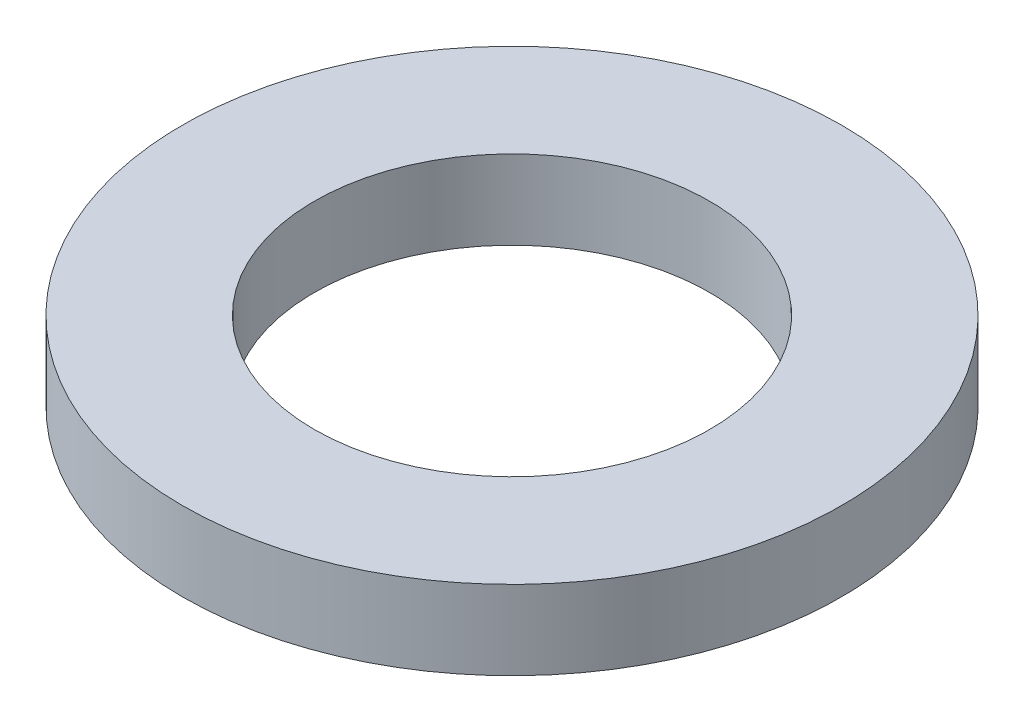
ISO-10303-21;
HEADER;
FILE_DESCRIPTION(('STEP AP214'),'2;1');
FILE_NAME('part.step','',(''),(''),'','','');
FILE_SCHEMA(('AUTOMOTIVE_DESIGN { 1 0 10303 214 1 1 1 1 }'));
ENDSEC;
DATA;
#1=APPLICATION_CONTEXT('core data for automotive mechanical design processes');
#2=APPLICATION_PROTOCOL_DEFINITION('international standard','automotive_design',2000,#1);
#3=PRODUCT_CONTEXT('',#1,'mechanical');
#4=PRODUCT('Part','Part','',(#3));
#5=PRODUCT_RELATED_PRODUCT_CATEGORY('part','',(#4));
#6=PRODUCT_DEFINITION_FORMATION('','',#4);
#7=PRODUCT_DEFINITION_CONTEXT('part definition',#1,'design');
#8=PRODUCT_DEFINITION('design','',#6,#7);
#9=PRODUCT_DEFINITION_SHAPE('','',#8);
#10=(LENGTH_UNIT() NAMED_UNIT(*) SI_UNIT(.MILLI.,.METRE.));
#11=(NAMED_UNIT(*) PLANE_ANGLE_UNIT() SI_UNIT($,.RADIAN.));
#12=(NAMED_UNIT(*) SI_UNIT($,.STERADIAN.) SOLID_ANGLE_UNIT());
#13=UNCERTAINTY_MEASURE_WITH_UNIT(LENGTH_MEASURE(1.E-05),#10,'distance_accuracy_value','');
#14=(GEOMETRIC_REPRESENTATION_CONTEXT(3) GLOBAL_UNCERTAINTY_ASSIGNED_CONTEXT((#13)) GLOBAL_UNIT_ASSIGNED_CONTEXT((#10,
#11,#12)) REPRESENTATION_CONTEXT('',''));
#15=CARTESIAN_POINT('',(0.,0.,0.));
#16=DIRECTION('',(0.,0.,1.));
#17=DIRECTION('',(1.,0.,0.));
#18=AXIS2_PLACEMENT_3D('',#15,#16,#17);
#19=CARTESIAN_POINT('',(0.,6.,0.));
#20=DIRECTION('',(0.,-1.,0.));
#21=DIRECTION('',(0.,0.,-1.));
#22=AXIS2_PLACEMENT_3D('',#19,#20,#21);
#23=CYLINDRICAL_SURFACE('',#22,25.);
#24=CARTESIAN_POINT('',(0.,6.,0.));
#25=DIRECTION('',(0.,1.,0.));
#26=DIRECTION('',(0.,0.,1.));
#27=AXIS2_PLACEMENT_3D('',#24,#25,#26);
#28=CIRCLE('',#27,25.);
#29=CARTESIAN_POINT('',(0.,6.,25.));
#30=VERTEX_POINT('',#29);
#31=EDGE_CURVE('E10',#30,#30,#28,.T.);
#32=ORIENTED_EDGE('',*,*,#31,.F.);
#33=EDGE_LOOP('',(#32));
#34=FACE_BOUND('',#33,.T.);
#35=CARTESIAN_POINT('',(0.,0.,0.));
#36=DIRECTION('',(0.,1.,0.));
#37=DIRECTION('',(0.,0.,1.));
#38=AXIS2_PLACEMENT_3D('',#35,#36,#37);
#39=CIRCLE('',#38,25.);
#40=CARTESIAN_POINT('',(0.,0.,25.));
#41=VERTEX_POINT('',#40);
#42=EDGE_CURVE('E37',#41,#41,#39,.T.);
#43=ORIENTED_EDGE('',*,*,#42,.T.);
#44=EDGE_LOOP('',(#43));
#45=FACE_BOUND('',#44,.T.);
#46=ADVANCED_FACE('F40',(#34,#45),#23,.T.);
#47=CARTESIAN_POINT('',(0.,6.,0.));
#48=DIRECTION('',(0.,1.,0.));
#49=DIRECTION('',(0.,0.,1.));
#50=AXIS2_PLACEMENT_3D('',#47,#48,#49);
#51=PLANE('',#50);
#52=CARTESIAN_POINT('',(0.,6.,0.));
#53=DIRECTION('',(0.,1.,0.));
#54=DIRECTION('',(0.,0.,1.));
#55=AXIS2_PLACEMENT_3D('',#52,#53,#54);
#56=CIRCLE('',#55,15.);
#57=CARTESIAN_POINT('',(0.,6.,15.));
#58=VERTEX_POINT('',#57);
#59=EDGE_CURVE('E50',#58,#58,#56,.T.);
#60=ORIENTED_EDGE('',*,*,#59,.F.);
#61=EDGE_LOOP('',(#60));
#62=FACE_BOUND('',#61,.T.);
#63=ORIENTED_EDGE('',*,*,#31,.T.);
#64=EDGE_LOOP('',(#63));
#65=FACE_BOUND('',#64,.T.);
#66=ADVANCED_FACE('F59',(#62,#65),#51,.T.);
#67=CARTESIAN_POINT('',(0.,0.,0.));
#68=DIRECTION('',(0.,1.,0.));
#69=DIRECTION('',(0.,0.,1.));
#70=AXIS2_PLACEMENT_3D('',#67,#68,#69);
#71=PLANE('',#70);
#72=CARTESIAN_POINT('',(0.,0.,0.));
#73=DIRECTION('',(0.,1.,0.));
#74=DIRECTION('',(0.,0.,1.));
#75=AXIS2_PLACEMENT_3D('',#72,#73,#74);
#76=CIRCLE('',#75,15.);
#77=CARTESIAN_POINT('',(0.,0.,15.));
#78=VERTEX_POINT('',#77);
#79=EDGE_CURVE('E47',#78,#78,#76,.T.);
#80=ORIENTED_EDGE('',*,*,#79,.T.);
#81=EDGE_LOOP('',(#80));
#82=FACE_BOUND('',#81,.T.);
#83=ORIENTED_EDGE('',*,*,#42,.F.);
#84=EDGE_LOOP('',(#83));
#85=FACE_BOUND('',#84,.T.);
#86=ADVANCED_FACE('F58',(#82,#85),#71,.F.);
#87=CARTESIAN_POINT('',(0.,6.,0.));
#88=DIRECTION('',(0.,-1.,0.));
#89=DIRECTION('',(0.,0.,-1.));
#90=AXIS2_PLACEMENT_3D('',#87,#88,#89);
#91=CYLINDRICAL_SURFACE('',#90,15.);
#92=ORIENTED_EDGE('',*,*,#59,.T.);
#93=EDGE_LOOP('',(#92));
#94=FACE_BOUND('',#93,.T.);
#95=ORIENTED_EDGE('',*,*,#79,.F.);
#96=EDGE_LOOP('',(#95));
#97=FACE_BOUND('',#96,.T.);
#98=ADVANCED_FACE('F54',(#94,#97),#91,.F.);
#99=CLOSED_SHELL('',(#46,#66,#86,#98));
#100=MANIFOLD_SOLID_BREP('B2',#99);
#101=ADVANCED_BREP_SHAPE_REPRESENTATION('',(#18,#100),#14);
#102=SHAPE_DEFINITION_REPRESENTATION(#9,#101);
ENDSEC;
END-ISO-10303-21;
